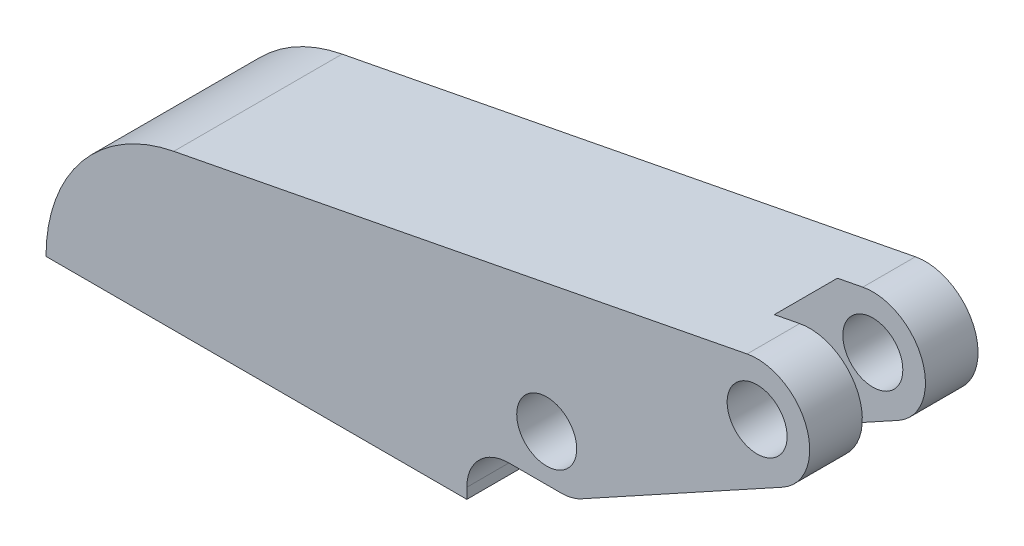
ISO-10303-21;
HEADER;
FILE_DESCRIPTION(('STEP AP214'),'2;1');
FILE_NAME('part.step','',(''),(''),'','','');
FILE_SCHEMA(('AUTOMOTIVE_DESIGN { 1 0 10303 214 1 1 1 1 }'));
ENDSEC;
DATA;
#1=APPLICATION_CONTEXT('core data for automotive mechanical design processes');
#2=APPLICATION_PROTOCOL_DEFINITION('international standard','automotive_design',2000,#1);
#3=PRODUCT_CONTEXT('',#1,'mechanical');
#4=PRODUCT('Part','Part','',(#3));
#5=PRODUCT_RELATED_PRODUCT_CATEGORY('part','',(#4));
#6=PRODUCT_DEFINITION_FORMATION('','',#4);
#7=PRODUCT_DEFINITION_CONTEXT('part definition',#1,'design');
#8=PRODUCT_DEFINITION('design','',#6,#7);
#9=PRODUCT_DEFINITION_SHAPE('','',#8);
#10=(LENGTH_UNIT() NAMED_UNIT(*) SI_UNIT(.MILLI.,.METRE.));
#11=(NAMED_UNIT(*) PLANE_ANGLE_UNIT() SI_UNIT($,.RADIAN.));
#12=(NAMED_UNIT(*) SI_UNIT($,.STERADIAN.) SOLID_ANGLE_UNIT());
#13=UNCERTAINTY_MEASURE_WITH_UNIT(LENGTH_MEASURE(1.E-05),#10,'distance_accuracy_value','');
#14=(GEOMETRIC_REPRESENTATION_CONTEXT(3) GLOBAL_UNCERTAINTY_ASSIGNED_CONTEXT((#13)) GLOBAL_UNIT_ASSIGNED_CONTEXT((#10,
#11,#12)) REPRESENTATION_CONTEXT('',''));
#15=CARTESIAN_POINT('',(0.,0.,0.));
#16=DIRECTION('',(0.,0.,1.));
#17=DIRECTION('',(1.,0.,0.));
#18=AXIS2_PLACEMENT_3D('',#15,#16,#17);
#19=CARTESIAN_POINT('',(45.8343180392922,14.7059179973023,16.));
#20=DIRECTION('',(-0.481918749772156,0.876215908676647,0.));
#21=DIRECTION('',(-0.876215908676647,-0.481918749772156,0.));
#22=AXIS2_PLACEMENT_3D('',#19,#20,#21);
#23=PLANE('',#22);
#24=DIRECTION('',(0.876215908676647,0.481918749772156,0.));
#25=VECTOR('',#24,1.);
#26=CARTESIAN_POINT('',(45.8343180392922,14.7059179973023,4.99999999999999));
#27=LINE('',#26,#25);
#28=CARTESIAN_POINT('',(42.5904062511392,12.9217665138182,5.));
#29=VERTEX_POINT('',#28);
#30=CARTESIAN_POINT('',(64.227719619958,24.8222888666685,4.99999999999999));
#31=VERTEX_POINT('',#30);
#32=EDGE_CURVE('E168',#29,#31,#27,.T.);
#33=ORIENTED_EDGE('',*,*,#32,.T.);
#34=DIRECTION('',(0.,0.,1.));
#35=VECTOR('',#34,1.);
#36=CARTESIAN_POINT('',(64.227719619958,24.8222888666685,16.));
#37=LINE('',#36,#35);
#38=CARTESIAN_POINT('',(64.2277196199582,24.8222888666686,11.));
#39=VERTEX_POINT('',#38);
#40=EDGE_CURVE('E14',#31,#39,#37,.T.);
#41=ORIENTED_EDGE('',*,*,#40,.T.);
#42=DIRECTION('',(0.876215908676647,0.481918749772156,0.));
#43=VECTOR('',#42,1.);
#44=CARTESIAN_POINT('',(86.6879313200957,37.1754053017442,11.));
#45=LINE('',#44,#43);
#46=CARTESIAN_POINT('',(42.5904062511392,12.9217665138182,11.));
#47=VERTEX_POINT('',#46);
#48=EDGE_CURVE('E386',#47,#39,#45,.T.);
#49=ORIENTED_EDGE('',*,*,#48,.F.);
#50=DIRECTION('',(0.,0.,1.));
#51=VECTOR('',#50,1.);
#52=CARTESIAN_POINT('',(42.5904062511392,12.9217665138182,11.));
#53=LINE('',#52,#51);
#54=EDGE_CURVE('E202',#29,#47,#53,.T.);
#55=ORIENTED_EDGE('',*,*,#54,.F.);
#56=EDGE_LOOP('',(#33,#41,#49,#55));
#57=FACE_BOUND('',#56,.T.);
#58=ADVANCED_FACE('F46',(#57),#23,.F.);
#59=CARTESIAN_POINT('',(72.5904062511392,62.8072690634833,11.));
#60=DIRECTION('',(0.,0.,-1.));
#61=DIRECTION('',(-1.,0.,0.));
#62=AXIS2_PLACEMENT_3D('',#59,#60,#61);
#63=PLANE('',#62);
#64=CARTESIAN_POINT('',(47.5904062511392,9.38107954338324,11.));
#65=DIRECTION('',(0.,0.,-1.));
#66=DIRECTION('',(-1.,0.,0.));
#67=AXIS2_PLACEMENT_3D('',#64,#65,#66);
#68=CIRCLE('',#67,2.85);
#69=CARTESIAN_POINT('',(44.7404062511392,9.38107954338324,11.));
#70=VERTEX_POINT('',#69);
#71=EDGE_CURVE('E380',#70,#70,#68,.T.);
#72=ORIENTED_EDGE('',*,*,#71,.F.);
#73=EDGE_LOOP('',(#72));
#74=FACE_BOUND('',#73,.T.);
#75=CARTESIAN_POINT('',(67.5904062511392,20.3810795433832,11.));
#76=DIRECTION('',(0.,0.,-1.));
#77=DIRECTION('',(-1.,0.,0.));
#78=AXIS2_PLACEMENT_3D('',#75,#76,#77);
#79=CIRCLE('',#78,2.85);
#80=CARTESIAN_POINT('',(64.7404062511392,20.3810795433832,11.));
#81=VERTEX_POINT('',#80);
#82=EDGE_CURVE('E201',#81,#81,#79,.T.);
#83=ORIENTED_EDGE('',*,*,#82,.F.);
#84=EDGE_LOOP('',(#83));
#85=FACE_BOUND('',#84,.T.);
#86=DIRECTION('',(-0.981723650130097,-0.190312045796475,0.));
#87=VECTOR('',#86,1.);
#88=CARTESIAN_POINT('',(12.1453193130529,14.7258547519514,11.));
#89=LINE('',#88,#87);
#90=CARTESIAN_POINT('',(66.6388460221569,25.2896977940337,11.));
#91=VERTEX_POINT('',#90);
#92=EDGE_CURVE('E53',#91,#39,#89,.T.);
#93=ORIENTED_EDGE('',*,*,#92,.F.);
#94=CARTESIAN_POINT('',(67.5904062511392,20.3810795433832,11.));
#95=DIRECTION('',(0.,0.,-1.));
#96=DIRECTION('',(-1.,0.,0.));
#97=AXIS2_PLACEMENT_3D('',#94,#95,#96);
#98=CIRCLE('',#97,5.);
#99=CARTESIAN_POINT('',(70.,16.,11.));
#100=VERTEX_POINT('',#99);
#101=EDGE_CURVE('E379',#100,#91,#98,.F.);
#102=ORIENTED_EDGE('',*,*,#101,.F.);
#103=DIRECTION('',(-0.876215908676647,-0.481918749772156,0.));
#104=VECTOR('',#103,1.);
#105=CARTESIAN_POINT('',(50.9002479368971,5.49513636529341,11.));
#106=LINE('',#105,#104);
#107=CARTESIAN_POINT('',(50.9002479368971,5.49513636529341,11.));
#108=VERTEX_POINT('',#107);
#109=EDGE_CURVE('E376',#100,#108,#106,.T.);
#110=ORIENTED_EDGE('',*,*,#109,.T.);
#111=CARTESIAN_POINT('',(48.9725729378085,9.,11.));
#112=DIRECTION('',(0.,0.,-1.));
#113=DIRECTION('',(-1.,0.,0.));
#114=AXIS2_PLACEMENT_3D('',#111,#112,#113);
#115=CIRCLE('',#114,4.);
#116=CARTESIAN_POINT('',(48.9725729378085,5.,11.));
#117=VERTEX_POINT('',#116);
#118=EDGE_CURVE('E371',#117,#108,#115,.F.);
#119=ORIENTED_EDGE('',*,*,#118,.F.);
#120=DIRECTION('',(-1.,0.,0.));
#121=VECTOR('',#120,1.);
#122=CARTESIAN_POINT('',(44.,5.,11.));
#123=LINE('',#122,#121);
#124=CARTESIAN_POINT('',(44.,5.,11.));
#125=VERTEX_POINT('',#124);
#126=EDGE_CURVE('E364',#117,#125,#123,.T.);
#127=ORIENTED_EDGE('',*,*,#126,.T.);
#128=CARTESIAN_POINT('',(44.,1.,11.));
#129=DIRECTION('',(0.,0.,-1.));
#130=DIRECTION('',(-1.,0.,0.));
#131=AXIS2_PLACEMENT_3D('',#128,#129,#130);
#132=CIRCLE('',#131,4.);
#133=CARTESIAN_POINT('',(42.5904062511392,4.74340025420374,11.));
#134=VERTEX_POINT('',#133);
#135=EDGE_CURVE('E310',#125,#134,#132,.F.);
#136=ORIENTED_EDGE('',*,*,#135,.T.);
#137=DIRECTION('',(0.,-1.,0.));
#138=VECTOR('',#137,1.);
#139=CARTESIAN_POINT('',(42.5904062511392,62.8072690634833,11.));
#140=LINE('',#139,#138);
#141=EDGE_CURVE('E185',#47,#134,#140,.T.);
#142=ORIENTED_EDGE('',*,*,#141,.F.);
#143=ORIENTED_EDGE('',*,*,#48,.T.);
#144=EDGE_LOOP('',(#93,#102,#110,#119,#127,#136,#142,#143));
#145=FACE_BOUND('',#144,.T.);
#146=ADVANCED_FACE('F452',(#74,#85,#145),#63,.T.);
#147=CARTESIAN_POINT('',(44.,1.,4.99999999999999));
#148=DIRECTION('',(0.,0.,1.));
#149=DIRECTION('',(1.,0.,0.));
#150=AXIS2_PLACEMENT_3D('',#147,#148,#149);
#151=PLANE('',#150);
#152=CARTESIAN_POINT('',(67.5904062511392,20.3810795433832,4.99999999999999));
#153=DIRECTION('',(0.,0.,-1.));
#154=DIRECTION('',(1.,0.,0.));
#155=AXIS2_PLACEMENT_3D('',#152,#153,#154);
#156=CIRCLE('',#155,2.85000000000001);
#157=CARTESIAN_POINT('',(70.4404062511392,20.3810795433832,4.99999999999999));
#158=VERTEX_POINT('',#157);
#159=EDGE_CURVE('E415',#158,#158,#156,.T.);
#160=ORIENTED_EDGE('',*,*,#159,.T.);
#161=EDGE_LOOP('',(#160));
#162=FACE_BOUND('',#161,.T.);
#163=CARTESIAN_POINT('',(47.5904062511392,9.38107954338324,4.99999999999999));
#164=DIRECTION('',(0.,0.,-1.));
#165=DIRECTION('',(1.,0.,0.));
#166=AXIS2_PLACEMENT_3D('',#163,#164,#165);
#167=CIRCLE('',#166,2.85);
#168=CARTESIAN_POINT('',(50.4404062511392,9.38107954338324,4.99999999999999));
#169=VERTEX_POINT('',#168);
#170=EDGE_CURVE('E403',#169,#169,#167,.T.);
#171=ORIENTED_EDGE('',*,*,#170,.T.);
#172=EDGE_LOOP('',(#171));
#173=FACE_BOUND('',#172,.T.);
#174=CARTESIAN_POINT('',(67.5904062511392,20.3810795433832,4.99999999999999));
#175=DIRECTION('',(0.,0.,-1.));
#176=DIRECTION('',(-1.,0.,0.));
#177=AXIS2_PLACEMENT_3D('',#174,#175,#176);
#178=CIRCLE('',#177,5.);
#179=CARTESIAN_POINT('',(66.6388460221569,25.2896977940337,4.99999999999999));
#180=VERTEX_POINT('',#179);
#181=CARTESIAN_POINT('',(70.,16.,4.99999999999999));
#182=VERTEX_POINT('',#181);
#183=EDGE_CURVE('E410',#180,#182,#178,.T.);
#184=ORIENTED_EDGE('',*,*,#183,.F.);
#185=DIRECTION('',(-0.981723650130097,-0.190312045796475,0.));
#186=VECTOR('',#185,1.);
#187=CARTESIAN_POINT('',(40.281811580834,20.1802546783549,4.99999999999999));
#188=LINE('',#187,#186);
#189=EDGE_CURVE('E187',#180,#31,#188,.T.);
#190=ORIENTED_EDGE('',*,*,#189,.T.);
#191=ORIENTED_EDGE('',*,*,#32,.F.);
#192=DIRECTION('',(0.,1.,0.));
#193=VECTOR('',#192,1.);
#194=CARTESIAN_POINT('',(42.5904062511392,4.74340025420374,5.));
#195=LINE('',#194,#193);
#196=CARTESIAN_POINT('',(42.5904062511392,4.74340025420374,5.));
#197=VERTEX_POINT('',#196);
#198=EDGE_CURVE('E161',#197,#29,#195,.T.);
#199=ORIENTED_EDGE('',*,*,#198,.F.);
#200=CARTESIAN_POINT('',(44.,1.,4.99999999999999));
#201=DIRECTION('',(0.,0.,1.));
#202=DIRECTION('',(1.,0.,0.));
#203=AXIS2_PLACEMENT_3D('',#200,#201,#202);
#204=CIRCLE('',#203,3.99999999999999);
#205=CARTESIAN_POINT('',(44.,5.,5.));
#206=VERTEX_POINT('',#205);
#207=EDGE_CURVE('E165',#206,#197,#204,.T.);
#208=ORIENTED_EDGE('',*,*,#207,.F.);
#209=DIRECTION('',(-1.,0.,0.));
#210=VECTOR('',#209,1.);
#211=CARTESIAN_POINT('',(48.9725729378085,5.,4.99999999999999));
#212=LINE('',#211,#210);
#213=CARTESIAN_POINT('',(48.9725729378085,5.,4.99999999999999));
#214=VERTEX_POINT('',#213);
#215=EDGE_CURVE('E391',#214,#206,#212,.T.);
#216=ORIENTED_EDGE('',*,*,#215,.F.);
#217=CARTESIAN_POINT('',(48.9725729378085,9.,4.99999999999999));
#218=DIRECTION('',(0.,0.,-1.));
#219=DIRECTION('',(-1.,0.,0.));
#220=AXIS2_PLACEMENT_3D('',#217,#218,#219);
#221=CIRCLE('',#220,4.);
#222=CARTESIAN_POINT('',(50.9002479368971,5.49513636529341,5.));
#223=VERTEX_POINT('',#222);
#224=EDGE_CURVE('E405',#223,#214,#221,.T.);
#225=ORIENTED_EDGE('',*,*,#224,.F.);
#226=DIRECTION('',(-0.876215908676647,-0.481918749772156,0.));
#227=VECTOR('',#226,1.);
#228=CARTESIAN_POINT('',(70.,16.,4.99999999999999));
#229=LINE('',#228,#227);
#230=EDGE_CURVE('E408',#182,#223,#229,.T.);
#231=ORIENTED_EDGE('',*,*,#230,.F.);
#232=EDGE_LOOP('',(#184,#190,#191,#199,#208,#216,#225,#231));
#233=FACE_BOUND('',#232,.T.);
#234=ADVANCED_FACE('F163',(#162,#173,#233),#151,.T.);
#235=CARTESIAN_POINT('',(67.5904062511392,20.3810795433832,16.));
#236=DIRECTION('',(0.,0.,-1.));
#237=DIRECTION('',(-1.,0.,0.));
#238=AXIS2_PLACEMENT_3D('',#235,#236,#237);
#239=CYLINDRICAL_SURFACE('',#238,5.);
#240=ORIENTED_EDGE('',*,*,#101,.T.);
#241=DIRECTION('',(0.,0.,-1.));
#242=VECTOR('',#241,1.);
#243=CARTESIAN_POINT('',(66.6388460221569,25.2896977940337,16.));
#244=LINE('',#243,#242);
#245=CARTESIAN_POINT('',(66.6388460221569,25.2896977940337,16.));
#246=VERTEX_POINT('',#245);
#247=EDGE_CURVE('E477',#246,#91,#244,.T.);
#248=ORIENTED_EDGE('',*,*,#247,.F.);
#249=CARTESIAN_POINT('',(67.5904062511392,20.3810795433832,16.));
#250=DIRECTION('',(0.,0.,-1.));
#251=DIRECTION('',(-1.,0.,0.));
#252=AXIS2_PLACEMENT_3D('',#249,#250,#251);
#253=CIRCLE('',#252,5.);
#254=CARTESIAN_POINT('',(70.,16.,16.));
#255=VERTEX_POINT('',#254);
#256=EDGE_CURVE('E281',#246,#255,#253,.T.);
#257=ORIENTED_EDGE('',*,*,#256,.T.);
#258=DIRECTION('',(0.,0.,-1.));
#259=VECTOR('',#258,1.);
#260=CARTESIAN_POINT('',(70.,16.,16.));
#261=LINE('',#260,#259);
#262=EDGE_CURVE('E344',#255,#100,#261,.T.);
#263=ORIENTED_EDGE('',*,*,#262,.T.);
#264=EDGE_LOOP('',(#240,#248,#257,#263));
#265=FACE_BOUND('',#264,.T.);
#266=ADVANCED_FACE('F476',(#265),#239,.T.);
#267=CARTESIAN_POINT('',(44.,1.,16.));
#268=DIRECTION('',(0.,0.,-1.));
#269=DIRECTION('',(-1.,0.,0.));
#270=AXIS2_PLACEMENT_3D('',#267,#268,#269);
#271=CYLINDRICAL_SURFACE('',#270,4.);
#272=CARTESIAN_POINT('',(44.,1.,0.));
#273=DIRECTION('',(0.,0.,-1.));
#274=DIRECTION('',(-1.,0.,0.));
#275=AXIS2_PLACEMENT_3D('',#272,#273,#274);
#276=CIRCLE('',#275,4.);
#277=CARTESIAN_POINT('',(40.,0.999999999999972,0.));
#278=VERTEX_POINT('',#277);
#279=CARTESIAN_POINT('',(44.,5.,0.));
#280=VERTEX_POINT('',#279);
#281=EDGE_CURVE('E254',#278,#280,#276,.T.);
#282=ORIENTED_EDGE('',*,*,#281,.T.);
#283=DIRECTION('',(0.,0.,-1.));
#284=VECTOR('',#283,1.);
#285=CARTESIAN_POINT('',(44.,5.,5.));
#286=LINE('',#285,#284);
#287=EDGE_CURVE('E179',#206,#280,#286,.T.);
#288=ORIENTED_EDGE('',*,*,#287,.F.);
#289=ORIENTED_EDGE('',*,*,#207,.T.);
#290=DIRECTION('',(0.,0.,-1.));
#291=VECTOR('',#290,1.);
#292=CARTESIAN_POINT('',(42.5904062511392,4.74340025420374,16.));
#293=LINE('',#292,#291);
#294=EDGE_CURVE('E177',#134,#197,#293,.T.);
#295=ORIENTED_EDGE('',*,*,#294,.F.);
#296=ORIENTED_EDGE('',*,*,#135,.F.);
#297=DIRECTION('',(0.,0.,-1.));
#298=VECTOR('',#297,1.);
#299=CARTESIAN_POINT('',(44.,5.,16.));
#300=LINE('',#299,#298);
#301=CARTESIAN_POINT('',(44.,5.,16.));
#302=VERTEX_POINT('',#301);
#303=EDGE_CURVE('E231',#302,#125,#300,.T.);
#304=ORIENTED_EDGE('',*,*,#303,.F.);
#305=CARTESIAN_POINT('',(44.,1.,16.));
#306=DIRECTION('',(0.,0.,-1.));
#307=DIRECTION('',(-1.,0.,0.));
#308=AXIS2_PLACEMENT_3D('',#305,#306,#307);
#309=CIRCLE('',#308,4.);
#310=CARTESIAN_POINT('',(40.,0.999999999999972,16.));
#311=VERTEX_POINT('',#310);
#312=EDGE_CURVE('E323',#311,#302,#309,.T.);
#313=ORIENTED_EDGE('',*,*,#312,.F.);
#314=DIRECTION('',(0.,0.,-1.));
#315=VECTOR('',#314,1.);
#316=CARTESIAN_POINT('',(40.,0.999999999999972,16.));
#317=LINE('',#316,#315);
#318=EDGE_CURVE('E226',#311,#278,#317,.T.);
#319=ORIENTED_EDGE('',*,*,#318,.T.);
#320=EDGE_LOOP('',(#282,#288,#289,#295,#296,#304,#313,#319));
#321=FACE_BOUND('',#320,.T.);
#322=ADVANCED_FACE('F175',(#321),#271,.F.);
#323=CARTESIAN_POINT('',(44.,5.,16.));
#324=DIRECTION('',(0.,1.,0.));
#325=DIRECTION('',(-1.,0.,0.));
#326=AXIS2_PLACEMENT_3D('',#323,#324,#325);
#327=PLANE('',#326);
#328=ORIENTED_EDGE('',*,*,#126,.F.);
#329=DIRECTION('',(0.,0.,-1.));
#330=VECTOR('',#329,1.);
#331=CARTESIAN_POINT('',(48.9725729378085,5.,16.));
#332=LINE('',#331,#330);
#333=CARTESIAN_POINT('',(48.9725729378085,5.,16.));
#334=VERTEX_POINT('',#333);
#335=EDGE_CURVE('E343',#334,#117,#332,.T.);
#336=ORIENTED_EDGE('',*,*,#335,.F.);
#337=DIRECTION('',(1.,0.,0.));
#338=VECTOR('',#337,1.);
#339=CARTESIAN_POINT('',(44.,5.,16.));
#340=LINE('',#339,#338);
#341=EDGE_CURVE('E327',#302,#334,#340,.T.);
#342=ORIENTED_EDGE('',*,*,#341,.F.);
#343=ORIENTED_EDGE('',*,*,#303,.T.);
#344=EDGE_LOOP('',(#328,#336,#342,#343));
#345=FACE_BOUND('',#344,.T.);
#346=ADVANCED_FACE('F363',(#345),#327,.F.);
#347=CARTESIAN_POINT('',(48.9725729378085,9.,16.));
#348=DIRECTION('',(0.,0.,-1.));
#349=DIRECTION('',(-1.,0.,0.));
#350=AXIS2_PLACEMENT_3D('',#347,#348,#349);
#351=CYLINDRICAL_SURFACE('',#350,4.);
#352=ORIENTED_EDGE('',*,*,#335,.T.);
#353=ORIENTED_EDGE('',*,*,#118,.T.);
#354=DIRECTION('',(0.,0.,-1.));
#355=VECTOR('',#354,1.);
#356=CARTESIAN_POINT('',(50.9002479368971,5.49513636529341,16.));
#357=LINE('',#356,#355);
#358=CARTESIAN_POINT('',(50.9002479368971,5.49513636529341,16.));
#359=VERTEX_POINT('',#358);
#360=EDGE_CURVE('E339',#359,#108,#357,.T.);
#361=ORIENTED_EDGE('',*,*,#360,.F.);
#362=CARTESIAN_POINT('',(48.9725729378085,9.,16.));
#363=DIRECTION('',(0.,0.,-1.));
#364=DIRECTION('',(-1.,0.,0.));
#365=AXIS2_PLACEMENT_3D('',#362,#363,#364);
#366=CIRCLE('',#365,4.);
#367=EDGE_CURVE('E859',#359,#334,#366,.T.);
#368=ORIENTED_EDGE('',*,*,#367,.T.);
#369=EDGE_LOOP('',(#352,#353,#361,#368));
#370=FACE_BOUND('',#369,.T.);
#371=ADVANCED_FACE('F563',(#370),#351,.T.);
#372=CARTESIAN_POINT('',(50.9002479368971,5.49513636529341,16.));
#373=DIRECTION('',(-0.481918749772156,0.876215908676647,0.));
#374=DIRECTION('',(-0.876215908676647,-0.481918749772156,0.));
#375=AXIS2_PLACEMENT_3D('',#372,#373,#374);
#376=PLANE('',#375);
#377=ORIENTED_EDGE('',*,*,#109,.F.);
#378=ORIENTED_EDGE('',*,*,#262,.F.);
#379=DIRECTION('',(0.876215908676647,0.481918749772156,0.));
#380=VECTOR('',#379,1.);
#381=CARTESIAN_POINT('',(50.9002479368971,5.49513636529341,16.));
#382=LINE('',#381,#380);
#383=EDGE_CURVE('E288',#359,#255,#382,.T.);
#384=ORIENTED_EDGE('',*,*,#383,.F.);
#385=ORIENTED_EDGE('',*,*,#360,.T.);
#386=EDGE_LOOP('',(#377,#378,#384,#385));
#387=FACE_BOUND('',#386,.T.);
#388=ADVANCED_FACE('F575',(#387),#376,.F.);
#389=CARTESIAN_POINT('',(66.6388460221569,25.2896977940337,0.));
#390=VERTEX_POINT('',#389);
#391=EDGE_CURVE('E484',#180,#390,#244,.T.);
#392=ORIENTED_EDGE('',*,*,#391,.F.);
#393=ORIENTED_EDGE('',*,*,#183,.T.);
#394=DIRECTION('',(0.,0.,-1.));
#395=VECTOR('',#394,1.);
#396=CARTESIAN_POINT('',(70.,16.,4.99999999999999));
#397=LINE('',#396,#395);
#398=CARTESIAN_POINT('',(70.,16.,0.));
#399=VERTEX_POINT('',#398);
#400=EDGE_CURVE('E387',#182,#399,#397,.T.);
#401=ORIENTED_EDGE('',*,*,#400,.T.);
#402=CARTESIAN_POINT('',(67.5904062511392,20.3810795433832,0.));
#403=DIRECTION('',(0.,0.,-1.));
#404=DIRECTION('',(-1.,0.,0.));
#405=AXIS2_PLACEMENT_3D('',#402,#403,#404);
#406=CIRCLE('',#405,5.);
#407=EDGE_CURVE('E261',#390,#399,#406,.T.);
#408=ORIENTED_EDGE('',*,*,#407,.F.);
#409=EDGE_LOOP('',(#392,#393,#401,#408));
#410=FACE_BOUND('',#409,.T.);
#411=ADVANCED_FACE('F587',(#410),#239,.T.);
#412=CARTESIAN_POINT('',(47.5904062511392,9.38107954338324,16.));
#413=DIRECTION('',(0.,0.,-1.));
#414=DIRECTION('',(-1.,0.,0.));
#415=AXIS2_PLACEMENT_3D('',#412,#413,#414);
#416=CYLINDRICAL_SURFACE('',#415,2.85);
#417=CARTESIAN_POINT('',(47.5904062511392,9.38107954338324,16.));
#418=DIRECTION('',(0.,0.,1.));
#419=DIRECTION('',(1.,0.,0.));
#420=AXIS2_PLACEMENT_3D('',#417,#418,#419);
#421=CIRCLE('',#420,2.85);
#422=CARTESIAN_POINT('',(50.4404062511392,9.38107954338324,16.));
#423=VERTEX_POINT('',#422);
#424=EDGE_CURVE('E295',#423,#423,#421,.T.);
#425=ORIENTED_EDGE('',*,*,#424,.T.);
#426=EDGE_LOOP('',(#425));
#427=FACE_BOUND('',#426,.T.);
#428=ORIENTED_EDGE('',*,*,#71,.T.);
#429=EDGE_LOOP('',(#428));
#430=FACE_BOUND('',#429,.T.);
#431=ADVANCED_FACE('F600',(#427,#430),#416,.F.);
#432=CARTESIAN_POINT('',(67.5904062511392,20.3810795433832,16.));
#433=DIRECTION('',(0.,0.,-1.));
#434=DIRECTION('',(-1.,0.,0.));
#435=AXIS2_PLACEMENT_3D('',#432,#433,#434);
#436=CYLINDRICAL_SURFACE('',#435,2.85);
#437=CARTESIAN_POINT('',(67.5904062511392,20.3810795433832,16.));
#438=DIRECTION('',(0.,0.,1.));
#439=DIRECTION('',(1.,0.,0.));
#440=AXIS2_PLACEMENT_3D('',#437,#438,#439);
#441=CIRCLE('',#440,2.85);
#442=CARTESIAN_POINT('',(70.4404062511392,20.3810795433832,16.));
#443=VERTEX_POINT('',#442);
#444=EDGE_CURVE('E302',#443,#443,#441,.T.);
#445=ORIENTED_EDGE('',*,*,#444,.T.);
#446=EDGE_LOOP('',(#445));
#447=FACE_BOUND('',#446,.T.);
#448=ORIENTED_EDGE('',*,*,#82,.T.);
#449=EDGE_LOOP('',(#448));
#450=FACE_BOUND('',#449,.T.);
#451=ADVANCED_FACE('F613',(#447,#450),#436,.F.);
#452=CARTESIAN_POINT('',(15.,0.,16.));
#453=DIRECTION('',(0.,0.,1.));
#454=DIRECTION('',(1.,0.,0.));
#455=AXIS2_PLACEMENT_3D('',#452,#453,#454);
#456=PLANE('',#455);
#457=ORIENTED_EDGE('',*,*,#424,.F.);
#458=EDGE_LOOP('',(#457));
#459=FACE_BOUND('',#458,.T.);
#460=CARTESIAN_POINT('',(15.,0.,16.));
#461=DIRECTION('',(0.,0.,1.));
#462=DIRECTION('',(1.,0.,0.));
#463=AXIS2_PLACEMENT_3D('',#460,#461,#462);
#464=CIRCLE('',#463,15.);
#465=CARTESIAN_POINT('',(12.1453193130529,14.7258547519514,16.));
#466=VERTEX_POINT('',#465);
#467=CARTESIAN_POINT('',(0.,0.,16.));
#468=VERTEX_POINT('',#467);
#469=EDGE_CURVE('E314',#466,#468,#464,.T.);
#470=ORIENTED_EDGE('',*,*,#469,.T.);
#471=DIRECTION('',(1.,0.,0.));
#472=VECTOR('',#471,1.);
#473=CARTESIAN_POINT('',(0.,0.,16.));
#474=LINE('',#473,#472);
#475=CARTESIAN_POINT('',(40.,0.,16.));
#476=VERTEX_POINT('',#475);
#477=EDGE_CURVE('E318',#468,#476,#474,.T.);
#478=ORIENTED_EDGE('',*,*,#477,.T.);
#479=DIRECTION('',(0.,1.,0.));
#480=VECTOR('',#479,1.);
#481=CARTESIAN_POINT('',(40.,0.,16.));
#482=LINE('',#481,#480);
#483=EDGE_CURVE('E245',#476,#311,#482,.T.);
#484=ORIENTED_EDGE('',*,*,#483,.T.);
#485=ORIENTED_EDGE('',*,*,#312,.T.);
#486=ORIENTED_EDGE('',*,*,#341,.T.);
#487=ORIENTED_EDGE('',*,*,#367,.F.);
#488=ORIENTED_EDGE('',*,*,#383,.T.);
#489=ORIENTED_EDGE('',*,*,#256,.F.);
#490=DIRECTION('',(0.981723650130097,0.190312045796475,0.));
#491=VECTOR('',#490,1.);
#492=CARTESIAN_POINT('',(12.1453193130529,14.7258547519514,16.));
#493=LINE('',#492,#491);
#494=EDGE_CURVE('E287',#466,#246,#493,.T.);
#495=ORIENTED_EDGE('',*,*,#494,.F.);
#496=EDGE_LOOP('',(#470,#478,#484,#485,#486,#487,#488,#489,#495));
#497=FACE_BOUND('',#496,.T.);
#498=ORIENTED_EDGE('',*,*,#444,.F.);
#499=EDGE_LOOP('',(#498));
#500=FACE_BOUND('',#499,.T.);
#501=ADVANCED_FACE('F435',(#459,#497,#500),#456,.T.);
#502=CARTESIAN_POINT('',(15.,0.,0.));
#503=DIRECTION('',(0.,0.,1.));
#504=DIRECTION('',(1.,0.,0.));
#505=AXIS2_PLACEMENT_3D('',#502,#503,#504);
#506=PLANE('',#505);
#507=DIRECTION('',(-1.,0.,0.));
#508=VECTOR('',#507,1.);
#509=CARTESIAN_POINT('',(48.9725729378085,5.,0.));
#510=LINE('',#509,#508);
#511=CARTESIAN_POINT('',(48.9725729378085,5.,0.));
#512=VERTEX_POINT('',#511);
#513=EDGE_CURVE('E180',#512,#280,#510,.T.);
#514=ORIENTED_EDGE('',*,*,#513,.T.);
#515=ORIENTED_EDGE('',*,*,#281,.F.);
#516=DIRECTION('',(0.,1.,0.));
#517=VECTOR('',#516,1.);
#518=CARTESIAN_POINT('',(40.,0.,0.));
#519=LINE('',#518,#517);
#520=CARTESIAN_POINT('',(40.,0.,0.));
#521=VERTEX_POINT('',#520);
#522=EDGE_CURVE('E244',#521,#278,#519,.T.);
#523=ORIENTED_EDGE('',*,*,#522,.F.);
#524=DIRECTION('',(1.,0.,0.));
#525=VECTOR('',#524,1.);
#526=CARTESIAN_POINT('',(0.,0.,0.));
#527=LINE('',#526,#525);
#528=CARTESIAN_POINT('',(0.,0.,0.));
#529=VERTEX_POINT('',#528);
#530=EDGE_CURVE('E253',#529,#521,#527,.T.);
#531=ORIENTED_EDGE('',*,*,#530,.F.);
#532=CARTESIAN_POINT('',(15.,0.,0.));
#533=DIRECTION('',(0.,0.,1.));
#534=DIRECTION('',(1.,0.,0.));
#535=AXIS2_PLACEMENT_3D('',#532,#533,#534);
#536=CIRCLE('',#535,15.);
#537=CARTESIAN_POINT('',(12.1453193130529,14.7258547519514,0.));
#538=VERTEX_POINT('',#537);
#539=EDGE_CURVE('E263',#538,#529,#536,.T.);
#540=ORIENTED_EDGE('',*,*,#539,.F.);
#541=DIRECTION('',(0.981723650130097,0.190312045796475,0.));
#542=VECTOR('',#541,1.);
#543=CARTESIAN_POINT('',(12.1453193130529,14.7258547519514,0.));
#544=LINE('',#543,#542);
#545=EDGE_CURVE('E270',#538,#390,#544,.T.);
#546=ORIENTED_EDGE('',*,*,#545,.T.);
#547=ORIENTED_EDGE('',*,*,#407,.T.);
#548=DIRECTION('',(-0.876215908676647,-0.481918749772156,0.));
#549=VECTOR('',#548,1.);
#550=CARTESIAN_POINT('',(70.,16.,0.));
#551=LINE('',#550,#549);
#552=CARTESIAN_POINT('',(50.9002479368971,5.49513636529341,0.));
#553=VERTEX_POINT('',#552);
#554=EDGE_CURVE('E400',#399,#553,#551,.T.);
#555=ORIENTED_EDGE('',*,*,#554,.T.);
#556=CARTESIAN_POINT('',(48.9725729378085,9.,0.));
#557=DIRECTION('',(0.,0.,-1.));
#558=DIRECTION('',(-1.,0.,0.));
#559=AXIS2_PLACEMENT_3D('',#556,#557,#558);
#560=CIRCLE('',#559,4.);
#561=EDGE_CURVE('E397',#553,#512,#560,.T.);
#562=ORIENTED_EDGE('',*,*,#561,.T.);
#563=EDGE_LOOP('',(#514,#515,#523,#531,#540,#546,#547,#555,#562));
#564=FACE_BOUND('',#563,.T.);
#565=CARTESIAN_POINT('',(67.5904062511392,20.3810795433832,0.));
#566=DIRECTION('',(0.,0.,-1.));
#567=DIRECTION('',(1.,0.,0.));
#568=AXIS2_PLACEMENT_3D('',#565,#566,#567);
#569=CIRCLE('',#568,2.85000000000001);
#570=CARTESIAN_POINT('',(70.4404062511392,20.3810795433832,0.));
#571=VERTEX_POINT('',#570);
#572=EDGE_CURVE('E418',#571,#571,#569,.T.);
#573=ORIENTED_EDGE('',*,*,#572,.F.);
#574=EDGE_LOOP('',(#573));
#575=FACE_BOUND('',#574,.T.);
#576=CARTESIAN_POINT('',(47.5904062511392,9.38107954338324,0.));
#577=DIRECTION('',(0.,0.,-1.));
#578=DIRECTION('',(1.,0.,0.));
#579=AXIS2_PLACEMENT_3D('',#576,#577,#578);
#580=CIRCLE('',#579,2.85);
#581=CARTESIAN_POINT('',(50.4404062511392,9.38107954338324,0.));
#582=VERTEX_POINT('',#581);
#583=EDGE_CURVE('E412',#582,#582,#580,.T.);
#584=ORIENTED_EDGE('',*,*,#583,.F.);
#585=EDGE_LOOP('',(#584));
#586=FACE_BOUND('',#585,.T.);
#587=ADVANCED_FACE('F250',(#564,#575,#586),#506,.F.);
#588=CARTESIAN_POINT('',(15.,0.,16.));
#589=DIRECTION('',(0.,0.,-1.));
#590=DIRECTION('',(-1.,0.,0.));
#591=AXIS2_PLACEMENT_3D('',#588,#589,#590);
#592=CYLINDRICAL_SURFACE('',#591,15.);
#593=ORIENTED_EDGE('',*,*,#539,.T.);
#594=DIRECTION('',(0.,0.,-1.));
#595=VECTOR('',#594,1.);
#596=CARTESIAN_POINT('',(0.,0.,16.));
#597=LINE('',#596,#595);
#598=EDGE_CURVE('E188',#468,#529,#597,.T.);
#599=ORIENTED_EDGE('',*,*,#598,.F.);
#600=ORIENTED_EDGE('',*,*,#469,.F.);
#601=DIRECTION('',(0.,0.,-1.));
#602=VECTOR('',#601,1.);
#603=CARTESIAN_POINT('',(12.1453193130529,14.7258547519514,16.));
#604=LINE('',#603,#602);
#605=EDGE_CURVE('E292',#466,#538,#604,.T.);
#606=ORIENTED_EDGE('',*,*,#605,.T.);
#607=EDGE_LOOP('',(#593,#599,#600,#606));
#608=FACE_BOUND('',#607,.T.);
#609=ADVANCED_FACE('F434',(#608),#592,.T.);
#610=CARTESIAN_POINT('',(0.,0.,16.));
#611=DIRECTION('',(0.,1.,0.));
#612=DIRECTION('',(0.,0.,1.));
#613=AXIS2_PLACEMENT_3D('',#610,#611,#612);
#614=PLANE('',#613);
#615=ORIENTED_EDGE('',*,*,#530,.T.);
#616=DIRECTION('',(0.,0.,-1.));
#617=VECTOR('',#616,1.);
#618=CARTESIAN_POINT('',(40.,0.,16.));
#619=LINE('',#618,#617);
#620=EDGE_CURVE('E196',#476,#521,#619,.T.);
#621=ORIENTED_EDGE('',*,*,#620,.F.);
#622=ORIENTED_EDGE('',*,*,#477,.F.);
#623=ORIENTED_EDGE('',*,*,#598,.T.);
#624=EDGE_LOOP('',(#615,#621,#622,#623));
#625=FACE_BOUND('',#624,.T.);
#626=ADVANCED_FACE('F658',(#625),#614,.F.);
#627=CARTESIAN_POINT('',(40.,0.,16.));
#628=DIRECTION('',(-1.,0.,0.));
#629=DIRECTION('',(0.,0.,1.));
#630=AXIS2_PLACEMENT_3D('',#627,#628,#629);
#631=PLANE('',#630);
#632=ORIENTED_EDGE('',*,*,#522,.T.);
#633=ORIENTED_EDGE('',*,*,#318,.F.);
#634=ORIENTED_EDGE('',*,*,#483,.F.);
#635=ORIENTED_EDGE('',*,*,#620,.T.);
#636=EDGE_LOOP('',(#632,#633,#634,#635));
#637=FACE_BOUND('',#636,.T.);
#638=ADVANCED_FACE('F242',(#637),#631,.F.);
#639=CARTESIAN_POINT('',(12.1453193130529,14.7258547519514,16.));
#640=DIRECTION('',(-0.190312045796475,0.981723650130097,0.));
#641=DIRECTION('',(-0.981723650130097,-0.190312045796475,0.));
#642=AXIS2_PLACEMENT_3D('',#639,#640,#641);
#643=PLANE('',#642);
#644=ORIENTED_EDGE('',*,*,#40,.F.);
#645=ORIENTED_EDGE('',*,*,#189,.F.);
#646=ORIENTED_EDGE('',*,*,#391,.T.);
#647=ORIENTED_EDGE('',*,*,#545,.F.);
#648=ORIENTED_EDGE('',*,*,#605,.F.);
#649=ORIENTED_EDGE('',*,*,#494,.T.);
#650=ORIENTED_EDGE('',*,*,#247,.T.);
#651=ORIENTED_EDGE('',*,*,#92,.T.);
#652=EDGE_LOOP('',(#644,#645,#646,#647,#648,#649,#650,#651));
#653=FACE_BOUND('',#652,.T.);
#654=ADVANCED_FACE('F481',(#653),#643,.T.);
#655=CARTESIAN_POINT('',(42.5904062511392,62.8072690634833,11.));
#656=DIRECTION('',(1.,0.,0.));
#657=DIRECTION('',(0.,0.,-1.));
#658=AXIS2_PLACEMENT_3D('',#655,#656,#657);
#659=PLANE('',#658);
#660=ORIENTED_EDGE('',*,*,#198,.T.);
#661=ORIENTED_EDGE('',*,*,#54,.T.);
#662=ORIENTED_EDGE('',*,*,#141,.T.);
#663=ORIENTED_EDGE('',*,*,#294,.T.);
#664=EDGE_LOOP('',(#660,#661,#662,#663));
#665=FACE_BOUND('',#664,.T.);
#666=ADVANCED_FACE('F183',(#665),#659,.T.);
#667=CARTESIAN_POINT('',(48.9725729378085,5.,4.99999999999999));
#668=DIRECTION('',(0.,-1.,0.));
#669=DIRECTION('',(0.,0.,-1.));
#670=AXIS2_PLACEMENT_3D('',#667,#668,#669);
#671=PLANE('',#670);
#672=ORIENTED_EDGE('',*,*,#513,.F.);
#673=DIRECTION('',(0.,0.,-1.));
#674=VECTOR('',#673,1.);
#675=CARTESIAN_POINT('',(48.9725729378085,5.,4.99999999999999));
#676=LINE('',#675,#674);
#677=EDGE_CURVE('E393',#214,#512,#676,.T.);
#678=ORIENTED_EDGE('',*,*,#677,.F.);
#679=ORIENTED_EDGE('',*,*,#215,.T.);
#680=ORIENTED_EDGE('',*,*,#287,.T.);
#681=EDGE_LOOP('',(#672,#678,#679,#680));
#682=FACE_BOUND('',#681,.T.);
#683=ADVANCED_FACE('F700',(#682),#671,.T.);
#684=CARTESIAN_POINT('',(48.9725729378085,9.,4.99999999999999));
#685=DIRECTION('',(0.,0.,-1.));
#686=DIRECTION('',(-1.,0.,0.));
#687=AXIS2_PLACEMENT_3D('',#684,#685,#686);
#688=CYLINDRICAL_SURFACE('',#687,4.);
#689=ORIENTED_EDGE('',*,*,#561,.F.);
#690=DIRECTION('',(0.,0.,-1.));
#691=VECTOR('',#690,1.);
#692=CARTESIAN_POINT('',(50.9002479368971,5.49513636529341,5.));
#693=LINE('',#692,#691);
#694=EDGE_CURVE('E390',#223,#553,#693,.T.);
#695=ORIENTED_EDGE('',*,*,#694,.F.);
#696=ORIENTED_EDGE('',*,*,#224,.T.);
#697=ORIENTED_EDGE('',*,*,#677,.T.);
#698=EDGE_LOOP('',(#689,#695,#696,#697));
#699=FACE_BOUND('',#698,.T.);
#700=ADVANCED_FACE('F446',(#699),#688,.T.);
#701=CARTESIAN_POINT('',(70.,16.,4.99999999999999));
#702=DIRECTION('',(0.481918749772156,-0.876215908676647,0.));
#703=DIRECTION('',(0.876215908676647,0.481918749772156,0.));
#704=AXIS2_PLACEMENT_3D('',#701,#702,#703);
#705=PLANE('',#704);
#706=ORIENTED_EDGE('',*,*,#554,.F.);
#707=ORIENTED_EDGE('',*,*,#400,.F.);
#708=ORIENTED_EDGE('',*,*,#230,.T.);
#709=ORIENTED_EDGE('',*,*,#694,.T.);
#710=EDGE_LOOP('',(#706,#707,#708,#709));
#711=FACE_BOUND('',#710,.T.);
#712=ADVANCED_FACE('F440',(#711),#705,.T.);
#713=CARTESIAN_POINT('',(47.5904062511392,9.38107954338324,4.99999999999999));
#714=DIRECTION('',(0.,0.,-1.));
#715=DIRECTION('',(-1.,0.,0.));
#716=AXIS2_PLACEMENT_3D('',#713,#714,#715);
#717=CYLINDRICAL_SURFACE('',#716,2.85);
#718=ORIENTED_EDGE('',*,*,#170,.F.);
#719=EDGE_LOOP('',(#718));
#720=FACE_BOUND('',#719,.T.);
#721=ORIENTED_EDGE('',*,*,#583,.T.);
#722=EDGE_LOOP('',(#721));
#723=FACE_BOUND('',#722,.T.);
#724=ADVANCED_FACE('F429',(#720,#723),#717,.F.);
#725=CARTESIAN_POINT('',(67.5904062511392,20.3810795433832,4.99999999999999));
#726=DIRECTION('',(0.,0.,-1.));
#727=DIRECTION('',(-1.,0.,0.));
#728=AXIS2_PLACEMENT_3D('',#725,#726,#727);
#729=CYLINDRICAL_SURFACE('',#728,2.85000000000001);
#730=ORIENTED_EDGE('',*,*,#159,.F.);
#731=EDGE_LOOP('',(#730));
#732=FACE_BOUND('',#731,.T.);
#733=ORIENTED_EDGE('',*,*,#572,.T.);
#734=EDGE_LOOP('',(#733));
#735=FACE_BOUND('',#734,.T.);
#736=ADVANCED_FACE('F426',(#732,#735),#729,.F.);
#737=CLOSED_SHELL('',(#58,#146,#234,#266,#322,#346,#371,#388,#411,#431,#451,#501,#587,#609,#626,
#638,#654,#666,#683,#700,#712,#724,#736));
#738=MANIFOLD_SOLID_BREP('B2',#737);
#739=ADVANCED_BREP_SHAPE_REPRESENTATION('',(#18,#738),#14);
#740=SHAPE_DEFINITION_REPRESENTATION(#9,#739);
ENDSEC;
END-ISO-10303-21;
